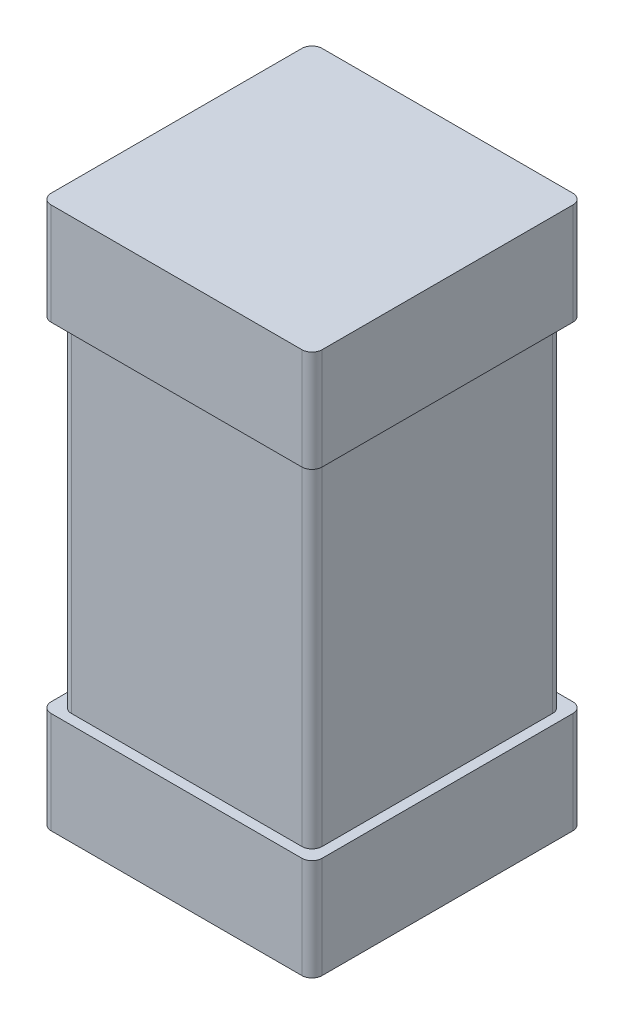
ISO-10303-21;
HEADER;
FILE_DESCRIPTION(('STEP AP214'),'2;1');
FILE_NAME('part.step','',(''),(''),'','','');
FILE_SCHEMA(('AUTOMOTIVE_DESIGN { 1 0 10303 214 1 1 1 1 }'));
ENDSEC;
DATA;
#1=APPLICATION_CONTEXT('core data for automotive mechanical design processes');
#2=APPLICATION_PROTOCOL_DEFINITION('international standard','automotive_design',2000,#1);
#3=PRODUCT_CONTEXT('',#1,'mechanical');
#4=PRODUCT('Part','Part','',(#3));
#5=PRODUCT_RELATED_PRODUCT_CATEGORY('part','',(#4));
#6=PRODUCT_DEFINITION_FORMATION('','',#4);
#7=PRODUCT_DEFINITION_CONTEXT('part definition',#1,'design');
#8=PRODUCT_DEFINITION('design','',#6,#7);
#9=PRODUCT_DEFINITION_SHAPE('','',#8);
#10=(LENGTH_UNIT() NAMED_UNIT(*) SI_UNIT(.MILLI.,.METRE.));
#11=(NAMED_UNIT(*) PLANE_ANGLE_UNIT() SI_UNIT($,.RADIAN.));
#12=(NAMED_UNIT(*) SI_UNIT($,.STERADIAN.) SOLID_ANGLE_UNIT());
#13=UNCERTAINTY_MEASURE_WITH_UNIT(LENGTH_MEASURE(1.E-05),#10,'distance_accuracy_value','');
#14=(GEOMETRIC_REPRESENTATION_CONTEXT(3) GLOBAL_UNCERTAINTY_ASSIGNED_CONTEXT((#13)) GLOBAL_UNIT_ASSIGNED_CONTEXT((#10,
#11,#12)) REPRESENTATION_CONTEXT('',''));
#15=CARTESIAN_POINT('',(0.,0.,0.));
#16=DIRECTION('',(0.,0.,1.));
#17=DIRECTION('',(1.,0.,0.));
#18=AXIS2_PLACEMENT_3D('',#15,#16,#17);
#19=CARTESIAN_POINT('',(150.716744279938,108.71204329235,142.211582908599));
#20=DIRECTION('',(0.,-1.,0.));
#21=DIRECTION('',(0.,0.,-1.));
#22=AXIS2_PLACEMENT_3D('',#19,#20,#21);
#23=PLANE('',#22);
#24=DIRECTION('',(0.,0.,1.));
#25=VECTOR('',#24,1.);
#26=CARTESIAN_POINT('',(150.716744279938,108.71204329235,142.211582908599));
#27=LINE('',#26,#25);
#28=CARTESIAN_POINT('',(150.716744279938,108.71204329235,142.241582908599));
#29=VERTEX_POINT('',#28);
#30=CARTESIAN_POINT('',(150.716744279938,108.71204329235,142.981582908599));
#31=VERTEX_POINT('',#30);
#32=EDGE_CURVE('E66',#29,#31,#27,.T.);
#33=ORIENTED_EDGE('',*,*,#32,.F.);
#34=CARTESIAN_POINT('',(150.746744279938,108.71204329235,142.241582908599));
#35=DIRECTION('',(0.,-1.,0.));
#36=DIRECTION('',(0.,0.,1.));
#37=AXIS2_PLACEMENT_3D('',#34,#35,#36);
#38=CIRCLE('',#37,0.0300000000000023);
#39=CARTESIAN_POINT('',(150.746744279938,108.71204329235,142.211582908599));
#40=VERTEX_POINT('',#39);
#41=EDGE_CURVE('E11',#29,#40,#38,.T.);
#42=ORIENTED_EDGE('',*,*,#41,.T.);
#43=DIRECTION('',(1.,0.,0.));
#44=VECTOR('',#43,1.);
#45=CARTESIAN_POINT('',(150.716744279938,108.71204329235,142.211582908599));
#46=LINE('',#45,#44);
#47=CARTESIAN_POINT('',(151.486744279938,108.71204329235,142.211582908599));
#48=VERTEX_POINT('',#47);
#49=EDGE_CURVE('E48',#40,#48,#46,.T.);
#50=ORIENTED_EDGE('',*,*,#49,.T.);
#51=CARTESIAN_POINT('',(151.486744279938,108.71204329235,142.241582908599));
#52=DIRECTION('',(0.,1.,0.));
#53=DIRECTION('',(0.,0.,1.));
#54=AXIS2_PLACEMENT_3D('',#51,#52,#53);
#55=CIRCLE('',#54,0.0300000000000023);
#56=CARTESIAN_POINT('',(151.516744279938,108.71204329235,142.241582908599));
#57=VERTEX_POINT('',#56);
#58=EDGE_CURVE('E179',#57,#48,#55,.T.);
#59=ORIENTED_EDGE('',*,*,#58,.F.);
#60=DIRECTION('',(0.,0.,1.));
#61=VECTOR('',#60,1.);
#62=CARTESIAN_POINT('',(151.516744279938,108.71204329235,142.211582908599));
#63=LINE('',#62,#61);
#64=CARTESIAN_POINT('',(151.516744279938,108.71204329235,142.981582908599));
#65=VERTEX_POINT('',#64);
#66=EDGE_CURVE('E393',#57,#65,#63,.T.);
#67=ORIENTED_EDGE('',*,*,#66,.T.);
#68=CARTESIAN_POINT('',(151.486744279938,108.71204329235,142.981582908599));
#69=DIRECTION('',(0.,-1.,0.));
#70=DIRECTION('',(0.,0.,1.));
#71=AXIS2_PLACEMENT_3D('',#68,#69,#70);
#72=CIRCLE('',#71,0.0300000000000023);
#73=CARTESIAN_POINT('',(151.486744279938,108.71204329235,143.011582908599));
#74=VERTEX_POINT('',#73);
#75=EDGE_CURVE('E389',#65,#74,#72,.T.);
#76=ORIENTED_EDGE('',*,*,#75,.T.);
#77=DIRECTION('',(1.,0.,0.));
#78=VECTOR('',#77,1.);
#79=CARTESIAN_POINT('',(150.716744279938,108.71204329235,143.011582908599));
#80=LINE('',#79,#78);
#81=CARTESIAN_POINT('',(150.746744279938,108.71204329235,143.011582908599));
#82=VERTEX_POINT('',#81);
#83=EDGE_CURVE('E330',#82,#74,#80,.T.);
#84=ORIENTED_EDGE('',*,*,#83,.F.);
#85=CARTESIAN_POINT('',(150.746744279938,108.71204329235,142.981582908599));
#86=DIRECTION('',(0.,1.,0.));
#87=DIRECTION('',(0.,0.,1.));
#88=AXIS2_PLACEMENT_3D('',#85,#86,#87);
#89=CIRCLE('',#88,0.0300000000000023);
#90=EDGE_CURVE('E298',#31,#82,#89,.T.);
#91=ORIENTED_EDGE('',*,*,#90,.F.);
#92=EDGE_LOOP('',(#33,#42,#50,#59,#67,#76,#84,#91));
#93=FACE_BOUND('',#92,.T.);
#94=ADVANCED_FACE('F44',(#93),#23,.T.);
#95=CARTESIAN_POINT('',(151.516744279938,109.01204329235,142.211582908599));
#96=DIRECTION('',(1.,0.,0.));
#97=DIRECTION('',(0.,1.,0.));
#98=AXIS2_PLACEMENT_3D('',#95,#96,#97);
#99=PLANE('',#98);
#100=ORIENTED_EDGE('',*,*,#66,.F.);
#101=DIRECTION('',(0.,-1.,0.));
#102=VECTOR('',#101,1.);
#103=CARTESIAN_POINT('',(151.516744279938,109.01204329235,142.241582908599));
#104=LINE('',#103,#102);
#105=CARTESIAN_POINT('',(151.516744279938,109.01204329235,142.241582908599));
#106=VERTEX_POINT('',#105);
#107=EDGE_CURVE('E321',#106,#57,#104,.T.);
#108=ORIENTED_EDGE('',*,*,#107,.F.);
#109=DIRECTION('',(0.,0.,1.));
#110=VECTOR('',#109,1.);
#111=CARTESIAN_POINT('',(151.516744279938,109.01204329235,142.211582908599));
#112=LINE('',#111,#110);
#113=CARTESIAN_POINT('',(151.516744279938,109.01204329235,142.981582908599));
#114=VERTEX_POINT('',#113);
#115=EDGE_CURVE('E394',#106,#114,#112,.T.);
#116=ORIENTED_EDGE('',*,*,#115,.T.);
#117=DIRECTION('',(0.,-1.,0.));
#118=VECTOR('',#117,1.);
#119=CARTESIAN_POINT('',(151.516744279938,109.01204329235,142.981582908599));
#120=LINE('',#119,#118);
#121=EDGE_CURVE('E325',#114,#65,#120,.T.);
#122=ORIENTED_EDGE('',*,*,#121,.T.);
#123=EDGE_LOOP('',(#100,#108,#116,#122));
#124=FACE_BOUND('',#123,.T.);
#125=ADVANCED_FACE('F579',(#124),#99,.T.);
#126=CARTESIAN_POINT('',(151.486744279938,109.01204329235,142.981582908599));
#127=DIRECTION('',(0.,-1.,0.));
#128=DIRECTION('',(1.,0.,0.));
#129=AXIS2_PLACEMENT_3D('',#126,#127,#128);
#130=CYLINDRICAL_SURFACE('',#129,0.0300000000000023);
#131=CARTESIAN_POINT('',(151.486744279938,109.01204329235,142.981582908599));
#132=DIRECTION('',(0.,-1.,0.));
#133=DIRECTION('',(0.,0.,1.));
#134=AXIS2_PLACEMENT_3D('',#131,#132,#133);
#135=CIRCLE('',#134,0.0300000000000023);
#136=CARTESIAN_POINT('',(151.486744279938,109.01204329235,143.011582908599));
#137=VERTEX_POINT('',#136);
#138=EDGE_CURVE('E320',#114,#137,#135,.T.);
#139=ORIENTED_EDGE('',*,*,#138,.T.);
#140=DIRECTION('',(0.,-1.,0.));
#141=VECTOR('',#140,1.);
#142=CARTESIAN_POINT('',(151.486744279938,109.01204329235,143.011582908599));
#143=LINE('',#142,#141);
#144=EDGE_CURVE('E316',#137,#74,#143,.T.);
#145=ORIENTED_EDGE('',*,*,#144,.T.);
#146=ORIENTED_EDGE('',*,*,#75,.F.);
#147=ORIENTED_EDGE('',*,*,#121,.F.);
#148=EDGE_LOOP('',(#139,#145,#146,#147));
#149=FACE_BOUND('',#148,.T.);
#150=ADVANCED_FACE('F582',(#149),#130,.T.);
#151=CARTESIAN_POINT('',(151.486744279938,109.01204329235,142.241582908599));
#152=DIRECTION('',(0.,-1.,0.));
#153=DIRECTION('',(1.,0.,0.));
#154=AXIS2_PLACEMENT_3D('',#151,#152,#153);
#155=CYLINDRICAL_SURFACE('',#154,0.0300000000000023);
#156=ORIENTED_EDGE('',*,*,#107,.T.);
#157=ORIENTED_EDGE('',*,*,#58,.T.);
#158=DIRECTION('',(0.,-1.,0.));
#159=VECTOR('',#158,1.);
#160=CARTESIAN_POINT('',(151.486744279938,109.01204329235,142.211582908599));
#161=LINE('',#160,#159);
#162=CARTESIAN_POINT('',(151.486744279938,109.01204329235,142.211582908599));
#163=VERTEX_POINT('',#162);
#164=EDGE_CURVE('E292',#163,#48,#161,.T.);
#165=ORIENTED_EDGE('',*,*,#164,.F.);
#166=CARTESIAN_POINT('',(151.486744279938,109.01204329235,142.241582908599));
#167=DIRECTION('',(0.,1.,0.));
#168=DIRECTION('',(0.,0.,1.));
#169=AXIS2_PLACEMENT_3D('',#166,#167,#168);
#170=CIRCLE('',#169,0.0300000000000023);
#171=EDGE_CURVE('E290',#106,#163,#170,.T.);
#172=ORIENTED_EDGE('',*,*,#171,.F.);
#173=EDGE_LOOP('',(#156,#157,#165,#172));
#174=FACE_BOUND('',#173,.T.);
#175=ADVANCED_FACE('F577',(#174),#155,.T.);
#176=CARTESIAN_POINT('',(150.716744279938,109.01204329235,143.011582908599));
#177=DIRECTION('',(0.,0.,1.));
#178=DIRECTION('',(1.,0.,0.));
#179=AXIS2_PLACEMENT_3D('',#176,#177,#178);
#180=PLANE('',#179);
#181=DIRECTION('',(1.,0.,0.));
#182=VECTOR('',#181,1.);
#183=CARTESIAN_POINT('',(150.716744279938,109.01204329235,143.011582908599));
#184=LINE('',#183,#182);
#185=CARTESIAN_POINT('',(150.746744279938,109.01204329235,143.011582908599));
#186=VERTEX_POINT('',#185);
#187=EDGE_CURVE('E371',#186,#137,#184,.T.);
#188=ORIENTED_EDGE('',*,*,#187,.F.);
#189=DIRECTION('',(0.,-1.,0.));
#190=VECTOR('',#189,1.);
#191=CARTESIAN_POINT('',(150.746744279938,109.01204329235,143.011582908599));
#192=LINE('',#191,#190);
#193=EDGE_CURVE('E326',#186,#82,#192,.T.);
#194=ORIENTED_EDGE('',*,*,#193,.T.);
#195=ORIENTED_EDGE('',*,*,#83,.T.);
#196=ORIENTED_EDGE('',*,*,#144,.F.);
#197=EDGE_LOOP('',(#188,#194,#195,#196));
#198=FACE_BOUND('',#197,.T.);
#199=ADVANCED_FACE('F586',(#198),#180,.T.);
#200=CARTESIAN_POINT('',(150.716744279938,109.01204329235,142.211582908599));
#201=DIRECTION('',(0.,0.,1.));
#202=DIRECTION('',(1.,0.,0.));
#203=AXIS2_PLACEMENT_3D('',#200,#201,#202);
#204=PLANE('',#203);
#205=ORIENTED_EDGE('',*,*,#164,.T.);
#206=ORIENTED_EDGE('',*,*,#49,.F.);
#207=DIRECTION('',(0.,-1.,0.));
#208=VECTOR('',#207,1.);
#209=CARTESIAN_POINT('',(150.746744279938,109.01204329235,142.211582908599));
#210=LINE('',#209,#208);
#211=CARTESIAN_POINT('',(150.746744279938,109.01204329235,142.211582908599));
#212=VERTEX_POINT('',#211);
#213=EDGE_CURVE('E270',#212,#40,#210,.T.);
#214=ORIENTED_EDGE('',*,*,#213,.F.);
#215=DIRECTION('',(1.,0.,0.));
#216=VECTOR('',#215,1.);
#217=CARTESIAN_POINT('',(150.716744279938,109.01204329235,142.211582908599));
#218=LINE('',#217,#216);
#219=EDGE_CURVE('E274',#212,#163,#218,.T.);
#220=ORIENTED_EDGE('',*,*,#219,.T.);
#221=EDGE_LOOP('',(#205,#206,#214,#220));
#222=FACE_BOUND('',#221,.T.);
#223=ADVANCED_FACE('F273',(#222),#204,.F.);
#224=CARTESIAN_POINT('',(150.746744279938,109.01204329235,142.981582908599));
#225=DIRECTION('',(0.,-1.,0.));
#226=DIRECTION('',(-1.,0.,0.));
#227=AXIS2_PLACEMENT_3D('',#224,#225,#226);
#228=CYLINDRICAL_SURFACE('',#227,0.0300000000000023);
#229=DIRECTION('',(0.,-1.,0.));
#230=VECTOR('',#229,1.);
#231=CARTESIAN_POINT('',(150.716744279938,109.01204329235,142.981582908599));
#232=LINE('',#231,#230);
#233=CARTESIAN_POINT('',(150.716744279938,109.01204329235,142.981582908599));
#234=VERTEX_POINT('',#233);
#235=EDGE_CURVE('E293',#234,#31,#232,.T.);
#236=ORIENTED_EDGE('',*,*,#235,.T.);
#237=ORIENTED_EDGE('',*,*,#90,.T.);
#238=ORIENTED_EDGE('',*,*,#193,.F.);
#239=CARTESIAN_POINT('',(150.746744279938,109.01204329235,142.981582908599));
#240=DIRECTION('',(0.,1.,0.));
#241=DIRECTION('',(0.,0.,1.));
#242=AXIS2_PLACEMENT_3D('',#239,#240,#241);
#243=CIRCLE('',#242,0.0300000000000023);
#244=EDGE_CURVE('E368',#234,#186,#243,.T.);
#245=ORIENTED_EDGE('',*,*,#244,.F.);
#246=EDGE_LOOP('',(#236,#237,#238,#245));
#247=FACE_BOUND('',#246,.T.);
#248=ADVANCED_FACE('F588',(#247),#228,.T.);
#249=CARTESIAN_POINT('',(150.746744279938,109.01204329235,142.241582908599));
#250=DIRECTION('',(0.,-1.,0.));
#251=DIRECTION('',(-1.,0.,0.));
#252=AXIS2_PLACEMENT_3D('',#249,#250,#251);
#253=CYLINDRICAL_SURFACE('',#252,0.0300000000000023);
#254=CARTESIAN_POINT('',(150.746744279938,109.01204329235,142.241582908599));
#255=DIRECTION('',(0.,-1.,0.));
#256=DIRECTION('',(0.,0.,1.));
#257=AXIS2_PLACEMENT_3D('',#254,#255,#256);
#258=CIRCLE('',#257,0.0300000000000023);
#259=CARTESIAN_POINT('',(150.716744279938,109.01204329235,142.241582908599));
#260=VERTEX_POINT('',#259);
#261=EDGE_CURVE('E278',#260,#212,#258,.T.);
#262=ORIENTED_EDGE('',*,*,#261,.T.);
#263=ORIENTED_EDGE('',*,*,#213,.T.);
#264=ORIENTED_EDGE('',*,*,#41,.F.);
#265=DIRECTION('',(0.,-1.,0.));
#266=VECTOR('',#265,1.);
#267=CARTESIAN_POINT('',(150.716744279938,109.01204329235,142.241582908599));
#268=LINE('',#267,#266);
#269=EDGE_CURVE('E279',#260,#29,#268,.T.);
#270=ORIENTED_EDGE('',*,*,#269,.F.);
#271=EDGE_LOOP('',(#262,#263,#264,#270));
#272=FACE_BOUND('',#271,.T.);
#273=ADVANCED_FACE('F295',(#272),#253,.T.);
#274=CARTESIAN_POINT('',(150.716744279938,109.01204329235,142.211582908599));
#275=DIRECTION('',(1.,0.,0.));
#276=DIRECTION('',(0.,1.,0.));
#277=AXIS2_PLACEMENT_3D('',#274,#275,#276);
#278=PLANE('',#277);
#279=ORIENTED_EDGE('',*,*,#235,.F.);
#280=DIRECTION('',(0.,0.,1.));
#281=VECTOR('',#280,1.);
#282=CARTESIAN_POINT('',(150.716744279938,109.01204329235,142.211582908599));
#283=LINE('',#282,#281);
#284=EDGE_CURVE('E347',#260,#234,#283,.T.);
#285=ORIENTED_EDGE('',*,*,#284,.F.);
#286=ORIENTED_EDGE('',*,*,#269,.T.);
#287=ORIENTED_EDGE('',*,*,#32,.T.);
#288=EDGE_LOOP('',(#279,#285,#286,#287));
#289=FACE_BOUND('',#288,.T.);
#290=ADVANCED_FACE('F591',(#289),#278,.F.);
#291=CARTESIAN_POINT('',(150.716744279938,109.01204329235,142.211582908599));
#292=DIRECTION('',(0.,-1.,0.));
#293=DIRECTION('',(0.,0.,-1.));
#294=AXIS2_PLACEMENT_3D('',#291,#292,#293);
#295=PLANE('',#294);
#296=ORIENTED_EDGE('',*,*,#244,.T.);
#297=ORIENTED_EDGE('',*,*,#187,.T.);
#298=ORIENTED_EDGE('',*,*,#138,.F.);
#299=ORIENTED_EDGE('',*,*,#115,.F.);
#300=ORIENTED_EDGE('',*,*,#171,.T.);
#301=ORIENTED_EDGE('',*,*,#219,.F.);
#302=ORIENTED_EDGE('',*,*,#261,.F.);
#303=ORIENTED_EDGE('',*,*,#284,.T.);
#304=EDGE_LOOP('',(#296,#297,#298,#299,#300,#301,#302,#303));
#305=FACE_BOUND('',#304,.T.);
#306=DIRECTION('',(1.,0.,0.));
#307=VECTOR('',#306,1.);
#308=CARTESIAN_POINT('',(150.746744279938,109.01204329235,142.241582908599));
#309=LINE('',#308,#307);
#310=CARTESIAN_POINT('',(150.776744279938,109.01204329235,142.241582908599));
#311=VERTEX_POINT('',#310);
#312=CARTESIAN_POINT('',(151.456744279938,109.01204329235,142.241582908599));
#313=VERTEX_POINT('',#312);
#314=EDGE_CURVE('E350',#311,#313,#309,.T.);
#315=ORIENTED_EDGE('',*,*,#314,.T.);
#316=CARTESIAN_POINT('',(151.456744279938,109.01204329235,142.271582908599));
#317=DIRECTION('',(0.,1.,0.));
#318=DIRECTION('',(0.,0.,1.));
#319=AXIS2_PLACEMENT_3D('',#316,#317,#318);
#320=CIRCLE('',#319,0.0300000000000023);
#321=CARTESIAN_POINT('',(151.486744279938,109.01204329235,142.271582908599));
#322=VERTEX_POINT('',#321);
#323=EDGE_CURVE('E477',#322,#313,#320,.T.);
#324=ORIENTED_EDGE('',*,*,#323,.F.);
#325=DIRECTION('',(0.,0.,1.));
#326=VECTOR('',#325,1.);
#327=CARTESIAN_POINT('',(151.486744279938,109.01204329235,142.241582908599));
#328=LINE('',#327,#326);
#329=CARTESIAN_POINT('',(151.486744279938,109.01204329235,142.951582908599));
#330=VERTEX_POINT('',#329);
#331=EDGE_CURVE('E351',#322,#330,#328,.T.);
#332=ORIENTED_EDGE('',*,*,#331,.T.);
#333=CARTESIAN_POINT('',(151.456744279938,109.01204329235,142.951582908599));
#334=DIRECTION('',(0.,-1.,0.));
#335=DIRECTION('',(0.,0.,1.));
#336=AXIS2_PLACEMENT_3D('',#333,#334,#335);
#337=CIRCLE('',#336,0.0300000000000023);
#338=CARTESIAN_POINT('',(151.456744279938,109.01204329235,142.981582908599));
#339=VERTEX_POINT('',#338);
#340=EDGE_CURVE('E355',#330,#339,#337,.T.);
#341=ORIENTED_EDGE('',*,*,#340,.T.);
#342=DIRECTION('',(1.,0.,0.));
#343=VECTOR('',#342,1.);
#344=CARTESIAN_POINT('',(150.746744279938,109.01204329235,142.981582908599));
#345=LINE('',#344,#343);
#346=CARTESIAN_POINT('',(150.776744279938,109.01204329235,142.981582908599));
#347=VERTEX_POINT('',#346);
#348=EDGE_CURVE('E376',#347,#339,#345,.T.);
#349=ORIENTED_EDGE('',*,*,#348,.F.);
#350=CARTESIAN_POINT('',(150.776744279938,109.01204329235,142.951582908599));
#351=DIRECTION('',(0.,1.,0.));
#352=DIRECTION('',(0.,0.,1.));
#353=AXIS2_PLACEMENT_3D('',#350,#351,#352);
#354=CIRCLE('',#353,0.0300000000000023);
#355=CARTESIAN_POINT('',(150.746744279938,109.01204329235,142.951582908599));
#356=VERTEX_POINT('',#355);
#357=EDGE_CURVE('E336',#356,#347,#354,.T.);
#358=ORIENTED_EDGE('',*,*,#357,.F.);
#359=DIRECTION('',(0.,0.,1.));
#360=VECTOR('',#359,1.);
#361=CARTESIAN_POINT('',(150.746744279938,109.01204329235,142.241582908599));
#362=LINE('',#361,#360);
#363=CARTESIAN_POINT('',(150.746744279938,109.01204329235,142.271582908599));
#364=VERTEX_POINT('',#363);
#365=EDGE_CURVE('E335',#364,#356,#362,.T.);
#366=ORIENTED_EDGE('',*,*,#365,.F.);
#367=CARTESIAN_POINT('',(150.776744279938,109.01204329235,142.271582908599));
#368=DIRECTION('',(0.,-1.,0.));
#369=DIRECTION('',(0.,0.,1.));
#370=AXIS2_PLACEMENT_3D('',#367,#368,#369);
#371=CIRCLE('',#370,0.0300000000000023);
#372=EDGE_CURVE('E453',#364,#311,#371,.T.);
#373=ORIENTED_EDGE('',*,*,#372,.T.);
#374=EDGE_LOOP('',(#315,#324,#332,#341,#349,#358,#366,#373));
#375=FACE_BOUND('',#374,.T.);
#376=ADVANCED_FACE('F284',(#305,#375),#295,.F.);
#377=CARTESIAN_POINT('',(150.746744279938,110.01204329235,142.241582908599));
#378=DIRECTION('',(1.,0.,0.));
#379=DIRECTION('',(0.,1.,0.));
#380=AXIS2_PLACEMENT_3D('',#377,#378,#379);
#381=PLANE('',#380);
#382=DIRECTION('',(0.,-1.,0.));
#383=VECTOR('',#382,1.);
#384=CARTESIAN_POINT('',(150.746744279938,110.01204329235,142.951582908599));
#385=LINE('',#384,#383);
#386=CARTESIAN_POINT('',(150.746744279938,110.01204329235,142.951582908599));
#387=VERTEX_POINT('',#386);
#388=EDGE_CURVE('E331',#387,#356,#385,.T.);
#389=ORIENTED_EDGE('',*,*,#388,.F.);
#390=DIRECTION('',(0.,0.,1.));
#391=VECTOR('',#390,1.);
#392=CARTESIAN_POINT('',(150.746744279938,110.01204329235,142.241582908599));
#393=LINE('',#392,#391);
#394=CARTESIAN_POINT('',(150.746744279938,110.01204329235,142.271582908599));
#395=VERTEX_POINT('',#394);
#396=EDGE_CURVE('E340',#395,#387,#393,.T.);
#397=ORIENTED_EDGE('',*,*,#396,.F.);
#398=DIRECTION('',(0.,-1.,0.));
#399=VECTOR('',#398,1.);
#400=CARTESIAN_POINT('',(150.746744279938,110.01204329235,142.271582908599));
#401=LINE('',#400,#399);
#402=EDGE_CURVE('E411',#395,#364,#401,.T.);
#403=ORIENTED_EDGE('',*,*,#402,.T.);
#404=ORIENTED_EDGE('',*,*,#365,.T.);
#405=EDGE_LOOP('',(#389,#397,#403,#404));
#406=FACE_BOUND('',#405,.T.);
#407=ADVANCED_FACE('F555',(#406),#381,.F.);
#408=CARTESIAN_POINT('',(150.776744279938,110.01204329235,142.951582908599));
#409=DIRECTION('',(0.,-1.,0.));
#410=DIRECTION('',(-1.,0.,0.));
#411=AXIS2_PLACEMENT_3D('',#408,#409,#410);
#412=CYLINDRICAL_SURFACE('',#411,0.0300000000000023);
#413=ORIENTED_EDGE('',*,*,#388,.T.);
#414=ORIENTED_EDGE('',*,*,#357,.T.);
#415=DIRECTION('',(0.,-1.,0.));
#416=VECTOR('',#415,1.);
#417=CARTESIAN_POINT('',(150.776744279938,110.01204329235,142.981582908599));
#418=LINE('',#417,#416);
#419=CARTESIAN_POINT('',(150.776744279938,110.01204329235,142.981582908599));
#420=VERTEX_POINT('',#419);
#421=EDGE_CURVE('E388',#420,#347,#418,.T.);
#422=ORIENTED_EDGE('',*,*,#421,.F.);
#423=CARTESIAN_POINT('',(150.776744279938,110.01204329235,142.951582908599));
#424=DIRECTION('',(0.,1.,0.));
#425=DIRECTION('',(0.,0.,1.));
#426=AXIS2_PLACEMENT_3D('',#423,#424,#425);
#427=CIRCLE('',#426,0.0300000000000023);
#428=EDGE_CURVE('E412',#387,#420,#427,.T.);
#429=ORIENTED_EDGE('',*,*,#428,.F.);
#430=EDGE_LOOP('',(#413,#414,#422,#429));
#431=FACE_BOUND('',#430,.T.);
#432=ADVANCED_FACE('F557',(#431),#412,.T.);
#433=CARTESIAN_POINT('',(150.746744279938,110.01204329235,142.981582908599));
#434=DIRECTION('',(0.,0.,1.));
#435=DIRECTION('',(1.,0.,0.));
#436=AXIS2_PLACEMENT_3D('',#433,#434,#435);
#437=PLANE('',#436);
#438=DIRECTION('',(1.,0.,0.));
#439=VECTOR('',#438,1.);
#440=CARTESIAN_POINT('',(150.746744279938,110.01204329235,142.981582908599));
#441=LINE('',#440,#439);
#442=CARTESIAN_POINT('',(151.456744279938,110.01204329235,142.981582908599));
#443=VERTEX_POINT('',#442);
#444=EDGE_CURVE('E404',#420,#443,#441,.T.);
#445=ORIENTED_EDGE('',*,*,#444,.F.);
#446=ORIENTED_EDGE('',*,*,#421,.T.);
#447=ORIENTED_EDGE('',*,*,#348,.T.);
#448=DIRECTION('',(0.,-1.,0.));
#449=VECTOR('',#448,1.);
#450=CARTESIAN_POINT('',(151.456744279938,110.01204329235,142.981582908599));
#451=LINE('',#450,#449);
#452=EDGE_CURVE('E377',#443,#339,#451,.T.);
#453=ORIENTED_EDGE('',*,*,#452,.F.);
#454=EDGE_LOOP('',(#445,#446,#447,#453));
#455=FACE_BOUND('',#454,.T.);
#456=ADVANCED_FACE('F561',(#455),#437,.T.);
#457=CARTESIAN_POINT('',(151.456744279938,110.01204329235,142.951582908599));
#458=DIRECTION('',(0.,-1.,0.));
#459=DIRECTION('',(1.,0.,0.));
#460=AXIS2_PLACEMENT_3D('',#457,#458,#459);
#461=CYLINDRICAL_SURFACE('',#460,0.0300000000000023);
#462=CARTESIAN_POINT('',(151.456744279938,110.01204329235,142.951582908599));
#463=DIRECTION('',(0.,-1.,0.));
#464=DIRECTION('',(0.,0.,1.));
#465=AXIS2_PLACEMENT_3D('',#462,#463,#464);
#466=CIRCLE('',#465,0.0300000000000023);
#467=CARTESIAN_POINT('',(151.486744279938,110.01204329235,142.951582908599));
#468=VERTEX_POINT('',#467);
#469=EDGE_CURVE('E372',#468,#443,#466,.T.);
#470=ORIENTED_EDGE('',*,*,#469,.T.);
#471=ORIENTED_EDGE('',*,*,#452,.T.);
#472=ORIENTED_EDGE('',*,*,#340,.F.);
#473=DIRECTION('',(0.,-1.,0.));
#474=VECTOR('',#473,1.);
#475=CARTESIAN_POINT('',(151.486744279938,110.01204329235,142.951582908599));
#476=LINE('',#475,#474);
#477=EDGE_CURVE('E378',#468,#330,#476,.T.);
#478=ORIENTED_EDGE('',*,*,#477,.F.);
#479=EDGE_LOOP('',(#470,#471,#472,#478));
#480=FACE_BOUND('',#479,.T.);
#481=ADVANCED_FACE('F564',(#480),#461,.T.);
#482=CARTESIAN_POINT('',(151.486744279938,110.01204329235,142.241582908599));
#483=DIRECTION('',(1.,0.,0.));
#484=DIRECTION('',(0.,1.,0.));
#485=AXIS2_PLACEMENT_3D('',#482,#483,#484);
#486=PLANE('',#485);
#487=ORIENTED_EDGE('',*,*,#331,.F.);
#488=DIRECTION('',(0.,-1.,0.));
#489=VECTOR('',#488,1.);
#490=CARTESIAN_POINT('',(151.486744279938,110.01204329235,142.271582908599));
#491=LINE('',#490,#489);
#492=CARTESIAN_POINT('',(151.486744279938,110.01204329235,142.271582908599));
#493=VERTEX_POINT('',#492);
#494=EDGE_CURVE('E383',#493,#322,#491,.T.);
#495=ORIENTED_EDGE('',*,*,#494,.F.);
#496=DIRECTION('',(0.,0.,1.));
#497=VECTOR('',#496,1.);
#498=CARTESIAN_POINT('',(151.486744279938,110.01204329235,142.241582908599));
#499=LINE('',#498,#497);
#500=EDGE_CURVE('E382',#493,#468,#499,.T.);
#501=ORIENTED_EDGE('',*,*,#500,.T.);
#502=ORIENTED_EDGE('',*,*,#477,.T.);
#503=EDGE_LOOP('',(#487,#495,#501,#502));
#504=FACE_BOUND('',#503,.T.);
#505=ADVANCED_FACE('F511',(#504),#486,.T.);
#506=CARTESIAN_POINT('',(151.456744279938,110.01204329235,142.271582908599));
#507=DIRECTION('',(0.,-1.,0.));
#508=DIRECTION('',(1.,0.,0.));
#509=AXIS2_PLACEMENT_3D('',#506,#507,#508);
#510=CYLINDRICAL_SURFACE('',#509,0.0300000000000023);
#511=ORIENTED_EDGE('',*,*,#494,.T.);
#512=ORIENTED_EDGE('',*,*,#323,.T.);
#513=DIRECTION('',(0.,-1.,0.));
#514=VECTOR('',#513,1.);
#515=CARTESIAN_POINT('',(151.456744279938,110.01204329235,142.241582908599));
#516=LINE('',#515,#514);
#517=CARTESIAN_POINT('',(151.456744279938,110.01204329235,142.241582908599));
#518=VERTEX_POINT('',#517);
#519=EDGE_CURVE('E480',#518,#313,#516,.T.);
#520=ORIENTED_EDGE('',*,*,#519,.F.);
#521=CARTESIAN_POINT('',(151.456744279938,110.01204329235,142.271582908599));
#522=DIRECTION('',(0.,1.,0.));
#523=DIRECTION('',(0.,0.,1.));
#524=AXIS2_PLACEMENT_3D('',#521,#522,#523);
#525=CIRCLE('',#524,0.0300000000000023);
#526=EDGE_CURVE('E401',#493,#518,#525,.T.);
#527=ORIENTED_EDGE('',*,*,#526,.F.);
#528=EDGE_LOOP('',(#511,#512,#520,#527));
#529=FACE_BOUND('',#528,.T.);
#530=ADVANCED_FACE('F505',(#529),#510,.T.);
#531=CARTESIAN_POINT('',(150.746744279938,110.01204329235,142.241582908599));
#532=DIRECTION('',(0.,0.,1.));
#533=DIRECTION('',(1.,0.,0.));
#534=AXIS2_PLACEMENT_3D('',#531,#532,#533);
#535=PLANE('',#534);
#536=ORIENTED_EDGE('',*,*,#519,.T.);
#537=ORIENTED_EDGE('',*,*,#314,.F.);
#538=DIRECTION('',(0.,-1.,0.));
#539=VECTOR('',#538,1.);
#540=CARTESIAN_POINT('',(150.776744279938,110.01204329235,142.241582908599));
#541=LINE('',#540,#539);
#542=CARTESIAN_POINT('',(150.776744279938,110.01204329235,142.241582908599));
#543=VERTEX_POINT('',#542);
#544=EDGE_CURVE('E425',#543,#311,#541,.T.);
#545=ORIENTED_EDGE('',*,*,#544,.F.);
#546=DIRECTION('',(1.,0.,0.));
#547=VECTOR('',#546,1.);
#548=CARTESIAN_POINT('',(150.746744279938,110.01204329235,142.241582908599));
#549=LINE('',#548,#547);
#550=EDGE_CURVE('E449',#543,#518,#549,.T.);
#551=ORIENTED_EDGE('',*,*,#550,.T.);
#552=EDGE_LOOP('',(#536,#537,#545,#551));
#553=FACE_BOUND('',#552,.T.);
#554=ADVANCED_FACE('F550',(#553),#535,.F.);
#555=CARTESIAN_POINT('',(150.776744279938,110.01204329235,142.271582908599));
#556=DIRECTION('',(0.,-1.,0.));
#557=DIRECTION('',(-1.,0.,0.));
#558=AXIS2_PLACEMENT_3D('',#555,#556,#557);
#559=CYLINDRICAL_SURFACE('',#558,0.0300000000000023);
#560=CARTESIAN_POINT('',(150.776744279938,110.01204329235,142.271582908599));
#561=DIRECTION('',(0.,-1.,0.));
#562=DIRECTION('',(0.,0.,1.));
#563=AXIS2_PLACEMENT_3D('',#560,#561,#562);
#564=CIRCLE('',#563,0.0300000000000023);
#565=EDGE_CURVE('E445',#395,#543,#564,.T.);
#566=ORIENTED_EDGE('',*,*,#565,.T.);
#567=ORIENTED_EDGE('',*,*,#544,.T.);
#568=ORIENTED_EDGE('',*,*,#372,.F.);
#569=ORIENTED_EDGE('',*,*,#402,.F.);
#570=EDGE_LOOP('',(#566,#567,#568,#569));
#571=FACE_BOUND('',#570,.T.);
#572=ADVANCED_FACE('F546',(#571),#559,.T.);
#573=CARTESIAN_POINT('',(150.716744279938,110.01204329235,142.211582908599));
#574=DIRECTION('',(0.,-1.,0.));
#575=DIRECTION('',(0.,0.,-1.));
#576=AXIS2_PLACEMENT_3D('',#573,#574,#575);
#577=PLANE('',#576);
#578=DIRECTION('',(0.,0.,1.));
#579=VECTOR('',#578,1.);
#580=CARTESIAN_POINT('',(150.716744279938,110.01204329235,142.211582908599));
#581=LINE('',#580,#579);
#582=CARTESIAN_POINT('',(150.716744279938,110.01204329235,142.241582908599));
#583=VERTEX_POINT('',#582);
#584=CARTESIAN_POINT('',(150.716744279938,110.01204329235,142.981582908599));
#585=VERTEX_POINT('',#584);
#586=EDGE_CURVE('E360',#583,#585,#581,.T.);
#587=ORIENTED_EDGE('',*,*,#586,.F.);
#588=CARTESIAN_POINT('',(150.746744279938,110.01204329235,142.241582908599));
#589=DIRECTION('',(0.,-1.,0.));
#590=DIRECTION('',(0.,0.,1.));
#591=AXIS2_PLACEMENT_3D('',#588,#589,#590);
#592=CIRCLE('',#591,0.0300000000000023);
#593=CARTESIAN_POINT('',(150.746744279938,110.01204329235,142.211582908599));
#594=VERTEX_POINT('',#593);
#595=EDGE_CURVE('E407',#583,#594,#592,.T.);
#596=ORIENTED_EDGE('',*,*,#595,.T.);
#597=DIRECTION('',(1.,0.,0.));
#598=VECTOR('',#597,1.);
#599=CARTESIAN_POINT('',(150.716744279938,110.01204329235,142.211582908599));
#600=LINE('',#599,#598);
#601=CARTESIAN_POINT('',(151.486744279938,110.01204329235,142.211582908599));
#602=VERTEX_POINT('',#601);
#603=EDGE_CURVE('E314',#594,#602,#600,.T.);
#604=ORIENTED_EDGE('',*,*,#603,.T.);
#605=CARTESIAN_POINT('',(151.486744279938,110.01204329235,142.241582908599));
#606=DIRECTION('',(0.,1.,0.));
#607=DIRECTION('',(0.,0.,1.));
#608=AXIS2_PLACEMENT_3D('',#605,#606,#607);
#609=CIRCLE('',#608,0.0300000000000023);
#610=CARTESIAN_POINT('',(151.516744279938,110.01204329235,142.241582908599));
#611=VERTEX_POINT('',#610);
#612=EDGE_CURVE('E97',#611,#602,#609,.T.);
#613=ORIENTED_EDGE('',*,*,#612,.F.);
#614=DIRECTION('',(0.,0.,1.));
#615=VECTOR('',#614,1.);
#616=CARTESIAN_POINT('',(151.516744279938,110.01204329235,142.211582908599));
#617=LINE('',#616,#615);
#618=CARTESIAN_POINT('',(151.516744279938,110.01204329235,142.981582908599));
#619=VERTEX_POINT('',#618);
#620=EDGE_CURVE('E311',#611,#619,#617,.T.);
#621=ORIENTED_EDGE('',*,*,#620,.T.);
#622=CARTESIAN_POINT('',(151.486744279938,110.01204329235,142.981582908599));
#623=DIRECTION('',(0.,-1.,0.));
#624=DIRECTION('',(0.,0.,1.));
#625=AXIS2_PLACEMENT_3D('',#622,#623,#624);
#626=CIRCLE('',#625,0.0300000000000023);
#627=CARTESIAN_POINT('',(151.486744279938,110.01204329235,143.011582908599));
#628=VERTEX_POINT('',#627);
#629=EDGE_CURVE('E315',#619,#628,#626,.T.);
#630=ORIENTED_EDGE('',*,*,#629,.T.);
#631=DIRECTION('',(1.,0.,0.));
#632=VECTOR('',#631,1.);
#633=CARTESIAN_POINT('',(150.716744279938,110.01204329235,143.011582908599));
#634=LINE('',#633,#632);
#635=CARTESIAN_POINT('',(150.746744279938,110.01204329235,143.011582908599));
#636=VERTEX_POINT('',#635);
#637=EDGE_CURVE('E421',#636,#628,#634,.T.);
#638=ORIENTED_EDGE('',*,*,#637,.F.);
#639=CARTESIAN_POINT('',(150.746744279938,110.01204329235,142.981582908599));
#640=DIRECTION('',(0.,1.,0.));
#641=DIRECTION('',(0.,0.,1.));
#642=AXIS2_PLACEMENT_3D('',#639,#640,#641);
#643=CIRCLE('',#642,0.0300000000000023);
#644=EDGE_CURVE('E367',#585,#636,#643,.T.);
#645=ORIENTED_EDGE('',*,*,#644,.F.);
#646=EDGE_LOOP('',(#587,#596,#604,#613,#621,#630,#638,#645));
#647=FACE_BOUND('',#646,.T.);
#648=ORIENTED_EDGE('',*,*,#565,.F.);
#649=ORIENTED_EDGE('',*,*,#396,.T.);
#650=ORIENTED_EDGE('',*,*,#428,.T.);
#651=ORIENTED_EDGE('',*,*,#444,.T.);
#652=ORIENTED_EDGE('',*,*,#469,.F.);
#653=ORIENTED_EDGE('',*,*,#500,.F.);
#654=ORIENTED_EDGE('',*,*,#526,.T.);
#655=ORIENTED_EDGE('',*,*,#550,.F.);
#656=EDGE_LOOP('',(#648,#649,#650,#651,#652,#653,#654,#655));
#657=FACE_BOUND('',#656,.T.);
#658=ADVANCED_FACE('F515',(#647,#657),#577,.T.);
#659=CARTESIAN_POINT('',(151.516744279938,110.31204329235,142.211582908599));
#660=DIRECTION('',(1.,0.,0.));
#661=DIRECTION('',(0.,1.,0.));
#662=AXIS2_PLACEMENT_3D('',#659,#660,#661);
#663=PLANE('',#662);
#664=ORIENTED_EDGE('',*,*,#620,.F.);
#665=DIRECTION('',(0.,-1.,0.));
#666=VECTOR('',#665,1.);
#667=CARTESIAN_POINT('',(151.516744279938,110.31204329235,142.241582908599));
#668=LINE('',#667,#666);
#669=CARTESIAN_POINT('',(151.516744279938,110.31204329235,142.241582908599));
#670=VERTEX_POINT('',#669);
#671=EDGE_CURVE('E432',#670,#611,#668,.T.);
#672=ORIENTED_EDGE('',*,*,#671,.F.);
#673=DIRECTION('',(0.,0.,1.));
#674=VECTOR('',#673,1.);
#675=CARTESIAN_POINT('',(151.516744279938,110.31204329235,142.211582908599));
#676=LINE('',#675,#674);
#677=CARTESIAN_POINT('',(151.516744279938,110.31204329235,142.981582908599));
#678=VERTEX_POINT('',#677);
#679=EDGE_CURVE('E345',#670,#678,#676,.T.);
#680=ORIENTED_EDGE('',*,*,#679,.T.);
#681=DIRECTION('',(0.,-1.,0.));
#682=VECTOR('',#681,1.);
#683=CARTESIAN_POINT('',(151.516744279938,110.31204329235,142.981582908599));
#684=LINE('',#683,#682);
#685=EDGE_CURVE('E341',#678,#619,#684,.T.);
#686=ORIENTED_EDGE('',*,*,#685,.T.);
#687=EDGE_LOOP('',(#664,#672,#680,#686));
#688=FACE_BOUND('',#687,.T.);
#689=ADVANCED_FACE('F628',(#688),#663,.T.);
#690=CARTESIAN_POINT('',(151.486744279938,110.31204329235,142.981582908599));
#691=DIRECTION('',(0.,-1.,0.));
#692=DIRECTION('',(1.,0.,0.));
#693=AXIS2_PLACEMENT_3D('',#690,#691,#692);
#694=CYLINDRICAL_SURFACE('',#693,0.0300000000000023);
#695=CARTESIAN_POINT('',(151.486744279938,110.31204329235,142.981582908599));
#696=DIRECTION('',(0.,-1.,0.));
#697=DIRECTION('',(0.,0.,1.));
#698=AXIS2_PLACEMENT_3D('',#695,#696,#697);
#699=CIRCLE('',#698,0.0300000000000023);
#700=CARTESIAN_POINT('',(151.486744279938,110.31204329235,143.011582908599));
#701=VERTEX_POINT('',#700);
#702=EDGE_CURVE('E346',#678,#701,#699,.T.);
#703=ORIENTED_EDGE('',*,*,#702,.T.);
#704=DIRECTION('',(0.,-1.,0.));
#705=VECTOR('',#704,1.);
#706=CARTESIAN_POINT('',(151.486744279938,110.31204329235,143.011582908599));
#707=LINE('',#706,#705);
#708=EDGE_CURVE('E428',#701,#628,#707,.T.);
#709=ORIENTED_EDGE('',*,*,#708,.T.);
#710=ORIENTED_EDGE('',*,*,#629,.F.);
#711=ORIENTED_EDGE('',*,*,#685,.F.);
#712=EDGE_LOOP('',(#703,#709,#710,#711));
#713=FACE_BOUND('',#712,.T.);
#714=ADVANCED_FACE('F624',(#713),#694,.T.);
#715=CARTESIAN_POINT('',(151.486744279938,110.31204329235,142.241582908599));
#716=DIRECTION('',(0.,-1.,0.));
#717=DIRECTION('',(1.,0.,0.));
#718=AXIS2_PLACEMENT_3D('',#715,#716,#717);
#719=CYLINDRICAL_SURFACE('',#718,0.0300000000000023);
#720=ORIENTED_EDGE('',*,*,#671,.T.);
#721=ORIENTED_EDGE('',*,*,#612,.T.);
#722=DIRECTION('',(0.,-1.,0.));
#723=VECTOR('',#722,1.);
#724=CARTESIAN_POINT('',(151.486744279938,110.31204329235,142.211582908599));
#725=LINE('',#724,#723);
#726=CARTESIAN_POINT('',(151.486744279938,110.31204329235,142.211582908599));
#727=VERTEX_POINT('',#726);
#728=EDGE_CURVE('E439',#727,#602,#725,.T.);
#729=ORIENTED_EDGE('',*,*,#728,.F.);
#730=CARTESIAN_POINT('',(151.486744279938,110.31204329235,142.241582908599));
#731=DIRECTION('',(0.,1.,0.));
#732=DIRECTION('',(0.,0.,1.));
#733=AXIS2_PLACEMENT_3D('',#730,#731,#732);
#734=CIRCLE('',#733,0.0300000000000023);
#735=EDGE_CURVE('E307',#670,#727,#734,.T.);
#736=ORIENTED_EDGE('',*,*,#735,.F.);
#737=EDGE_LOOP('',(#720,#721,#729,#736));
#738=FACE_BOUND('',#737,.T.);
#739=ADVANCED_FACE('F627',(#738),#719,.T.);
#740=CARTESIAN_POINT('',(150.716744279938,110.31204329235,143.011582908599));
#741=DIRECTION('',(0.,0.,1.));
#742=DIRECTION('',(1.,0.,0.));
#743=AXIS2_PLACEMENT_3D('',#740,#741,#742);
#744=PLANE('',#743);
#745=DIRECTION('',(1.,0.,0.));
#746=VECTOR('',#745,1.);
#747=CARTESIAN_POINT('',(150.716744279938,110.31204329235,143.011582908599));
#748=LINE('',#747,#746);
#749=CARTESIAN_POINT('',(150.746744279938,110.31204329235,143.011582908599));
#750=VERTEX_POINT('',#749);
#751=EDGE_CURVE('E361',#750,#701,#748,.T.);
#752=ORIENTED_EDGE('',*,*,#751,.F.);
#753=DIRECTION('',(0.,-1.,0.));
#754=VECTOR('',#753,1.);
#755=CARTESIAN_POINT('',(150.746744279938,110.31204329235,143.011582908599));
#756=LINE('',#755,#754);
#757=EDGE_CURVE('E417',#750,#636,#756,.T.);
#758=ORIENTED_EDGE('',*,*,#757,.T.);
#759=ORIENTED_EDGE('',*,*,#637,.T.);
#760=ORIENTED_EDGE('',*,*,#708,.F.);
#761=EDGE_LOOP('',(#752,#758,#759,#760));
#762=FACE_BOUND('',#761,.T.);
#763=ADVANCED_FACE('F648',(#762),#744,.T.);
#764=CARTESIAN_POINT('',(150.716744279938,110.31204329235,142.211582908599));
#765=DIRECTION('',(0.,0.,1.));
#766=DIRECTION('',(1.,0.,0.));
#767=AXIS2_PLACEMENT_3D('',#764,#765,#766);
#768=PLANE('',#767);
#769=ORIENTED_EDGE('',*,*,#728,.T.);
#770=ORIENTED_EDGE('',*,*,#603,.F.);
#771=DIRECTION('',(0.,-1.,0.));
#772=VECTOR('',#771,1.);
#773=CARTESIAN_POINT('',(150.746744279938,110.31204329235,142.211582908599));
#774=LINE('',#773,#772);
#775=CARTESIAN_POINT('',(150.746744279938,110.31204329235,142.211582908599));
#776=VERTEX_POINT('',#775);
#777=EDGE_CURVE('E463',#776,#594,#774,.T.);
#778=ORIENTED_EDGE('',*,*,#777,.F.);
#779=DIRECTION('',(1.,0.,0.));
#780=VECTOR('',#779,1.);
#781=CARTESIAN_POINT('',(150.716744279938,110.31204329235,142.211582908599));
#782=LINE('',#781,#780);
#783=EDGE_CURVE('E366',#776,#727,#782,.T.);
#784=ORIENTED_EDGE('',*,*,#783,.T.);
#785=EDGE_LOOP('',(#769,#770,#778,#784));
#786=FACE_BOUND('',#785,.T.);
#787=ADVANCED_FACE('F651',(#786),#768,.F.);
#788=CARTESIAN_POINT('',(150.746744279938,110.31204329235,142.981582908599));
#789=DIRECTION('',(0.,-1.,0.));
#790=DIRECTION('',(-1.,0.,0.));
#791=AXIS2_PLACEMENT_3D('',#788,#789,#790);
#792=CYLINDRICAL_SURFACE('',#791,0.0300000000000023);
#793=DIRECTION('',(0.,-1.,0.));
#794=VECTOR('',#793,1.);
#795=CARTESIAN_POINT('',(150.716744279938,110.31204329235,142.981582908599));
#796=LINE('',#795,#794);
#797=CARTESIAN_POINT('',(150.716744279938,110.31204329235,142.981582908599));
#798=VERTEX_POINT('',#797);
#799=EDGE_CURVE('E362',#798,#585,#796,.T.);
#800=ORIENTED_EDGE('',*,*,#799,.T.);
#801=ORIENTED_EDGE('',*,*,#644,.T.);
#802=ORIENTED_EDGE('',*,*,#757,.F.);
#803=CARTESIAN_POINT('',(150.746744279938,110.31204329235,142.981582908599));
#804=DIRECTION('',(0.,1.,0.));
#805=DIRECTION('',(0.,0.,1.));
#806=AXIS2_PLACEMENT_3D('',#803,#804,#805);
#807=CIRCLE('',#806,0.0300000000000023);
#808=EDGE_CURVE('E356',#798,#750,#807,.T.);
#809=ORIENTED_EDGE('',*,*,#808,.F.);
#810=EDGE_LOOP('',(#800,#801,#802,#809));
#811=FACE_BOUND('',#810,.T.);
#812=ADVANCED_FACE('F612',(#811),#792,.T.);
#813=CARTESIAN_POINT('',(150.746744279938,110.31204329235,142.241582908599));
#814=DIRECTION('',(0.,-1.,0.));
#815=DIRECTION('',(-1.,0.,0.));
#816=AXIS2_PLACEMENT_3D('',#813,#814,#815);
#817=CYLINDRICAL_SURFACE('',#816,0.0300000000000023);
#818=CARTESIAN_POINT('',(150.746744279938,110.31204329235,142.241582908599));
#819=DIRECTION('',(0.,-1.,0.));
#820=DIRECTION('',(0.,0.,1.));
#821=AXIS2_PLACEMENT_3D('',#818,#819,#820);
#822=CIRCLE('',#821,0.0300000000000023);
#823=CARTESIAN_POINT('',(150.716744279938,110.31204329235,142.241582908599));
#824=VERTEX_POINT('',#823);
#825=EDGE_CURVE('E459',#824,#776,#822,.T.);
#826=ORIENTED_EDGE('',*,*,#825,.T.);
#827=ORIENTED_EDGE('',*,*,#777,.T.);
#828=ORIENTED_EDGE('',*,*,#595,.F.);
#829=DIRECTION('',(0.,-1.,0.));
#830=VECTOR('',#829,1.);
#831=CARTESIAN_POINT('',(150.716744279938,110.31204329235,142.241582908599));
#832=LINE('',#831,#830);
#833=EDGE_CURVE('E476',#824,#583,#832,.T.);
#834=ORIENTED_EDGE('',*,*,#833,.F.);
#835=EDGE_LOOP('',(#826,#827,#828,#834));
#836=FACE_BOUND('',#835,.T.);
#837=ADVANCED_FACE('F46',(#836),#817,.T.);
#838=CARTESIAN_POINT('',(150.716744279938,110.31204329235,142.211582908599));
#839=DIRECTION('',(1.,0.,0.));
#840=DIRECTION('',(0.,1.,0.));
#841=AXIS2_PLACEMENT_3D('',#838,#839,#840);
#842=PLANE('',#841);
#843=ORIENTED_EDGE('',*,*,#799,.F.);
#844=DIRECTION('',(0.,0.,1.));
#845=VECTOR('',#844,1.);
#846=CARTESIAN_POINT('',(150.716744279938,110.31204329235,142.211582908599));
#847=LINE('',#846,#845);
#848=EDGE_CURVE('E495',#824,#798,#847,.T.);
#849=ORIENTED_EDGE('',*,*,#848,.F.);
#850=ORIENTED_EDGE('',*,*,#833,.T.);
#851=ORIENTED_EDGE('',*,*,#586,.T.);
#852=EDGE_LOOP('',(#843,#849,#850,#851));
#853=FACE_BOUND('',#852,.T.);
#854=ADVANCED_FACE('F620',(#853),#842,.F.);
#855=CARTESIAN_POINT('',(150.716744279938,110.31204329235,142.211582908599));
#856=DIRECTION('',(0.,-1.,0.));
#857=DIRECTION('',(0.,0.,-1.));
#858=AXIS2_PLACEMENT_3D('',#855,#856,#857);
#859=PLANE('',#858);
#860=ORIENTED_EDGE('',*,*,#808,.T.);
#861=ORIENTED_EDGE('',*,*,#751,.T.);
#862=ORIENTED_EDGE('',*,*,#702,.F.);
#863=ORIENTED_EDGE('',*,*,#679,.F.);
#864=ORIENTED_EDGE('',*,*,#735,.T.);
#865=ORIENTED_EDGE('',*,*,#783,.F.);
#866=ORIENTED_EDGE('',*,*,#825,.F.);
#867=ORIENTED_EDGE('',*,*,#848,.T.);
#868=EDGE_LOOP('',(#860,#861,#862,#863,#864,#865,#866,#867));
#869=FACE_BOUND('',#868,.T.);
#870=ADVANCED_FACE('F617',(#869),#859,.F.);
#871=CLOSED_SHELL('',(#94,#125,#150,#175,#199,#223,#248,#273,#290,#376,#407,#432,#456,#481,#505,
#530,#554,#572,#658,#689,#714,#739,#763,#787,#812,#837,#854,#870));
#872=MANIFOLD_SOLID_BREP('B2',#871);
#873=ADVANCED_BREP_SHAPE_REPRESENTATION('',(#18,#872),#14);
#874=SHAPE_DEFINITION_REPRESENTATION(#9,#873);
ENDSEC;
END-ISO-10303-21;
